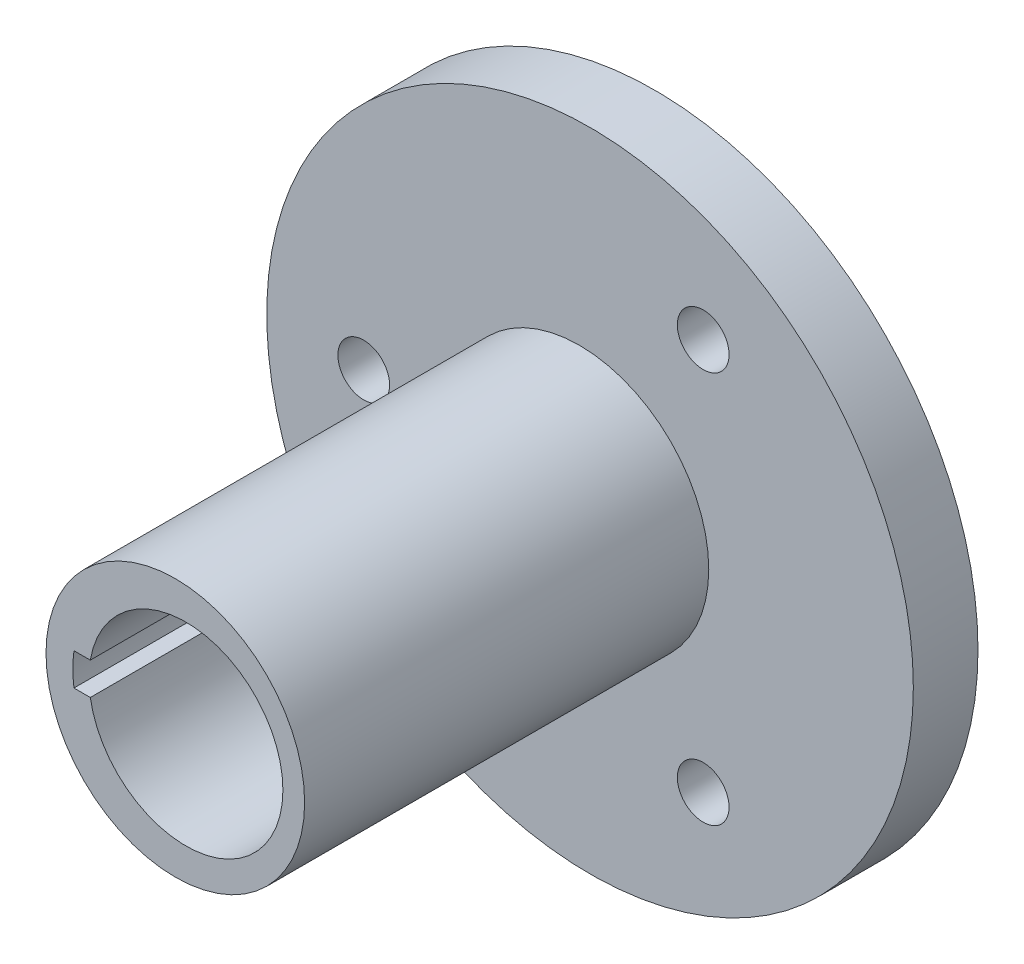
ISO-10303-21;
HEADER;
FILE_DESCRIPTION(('STEP AP214'),'2;1');
FILE_NAME('part.step','',(''),(''),'','','');
FILE_SCHEMA(('AUTOMOTIVE_DESIGN { 1 0 10303 214 1 1 1 1 }'));
ENDSEC;
DATA;
#1=APPLICATION_CONTEXT('core data for automotive mechanical design processes');
#2=APPLICATION_PROTOCOL_DEFINITION('international standard','automotive_design',2000,#1);
#3=PRODUCT_CONTEXT('',#1,'mechanical');
#4=PRODUCT('Part','Part','',(#3));
#5=PRODUCT_RELATED_PRODUCT_CATEGORY('part','',(#4));
#6=PRODUCT_DEFINITION_FORMATION('','',#4);
#7=PRODUCT_DEFINITION_CONTEXT('part definition',#1,'design');
#8=PRODUCT_DEFINITION('design','',#6,#7);
#9=PRODUCT_DEFINITION_SHAPE('','',#8);
#10=(LENGTH_UNIT() NAMED_UNIT(*) SI_UNIT(.MILLI.,.METRE.));
#11=(NAMED_UNIT(*) PLANE_ANGLE_UNIT() SI_UNIT($,.RADIAN.));
#12=(NAMED_UNIT(*) SI_UNIT($,.STERADIAN.) SOLID_ANGLE_UNIT());
#13=UNCERTAINTY_MEASURE_WITH_UNIT(LENGTH_MEASURE(1.E-05),#10,'distance_accuracy_value','');
#14=(GEOMETRIC_REPRESENTATION_CONTEXT(3) GLOBAL_UNCERTAINTY_ASSIGNED_CONTEXT((#13)) GLOBAL_UNIT_ASSIGNED_CONTEXT((#10,
#11,#12)) REPRESENTATION_CONTEXT('',''));
#15=CARTESIAN_POINT('',(0.,0.,0.));
#16=DIRECTION('',(0.,0.,1.));
#17=DIRECTION('',(1.,0.,0.));
#18=AXIS2_PLACEMENT_3D('',#15,#16,#17);
#19=CARTESIAN_POINT('',(0.,0.,0.));
#20=DIRECTION('',(0.,0.,1.));
#21=DIRECTION('',(1.,0.,0.));
#22=AXIS2_PLACEMENT_3D('',#19,#20,#21);
#23=PLANE('',#22);
#24=CARTESIAN_POINT('',(0.,0.,0.));
#25=DIRECTION('',(0.,0.,1.));
#26=DIRECTION('',(1.,0.,0.));
#27=AXIS2_PLACEMENT_3D('',#24,#25,#26);
#28=CIRCLE('',#27,50.);
#29=CARTESIAN_POINT('',(50.,0.,0.));
#30=VERTEX_POINT('',#29);
#31=EDGE_CURVE('E43',#30,#30,#28,.T.);
#32=ORIENTED_EDGE('',*,*,#31,.T.);
#33=EDGE_LOOP('',(#32));
#34=FACE_BOUND('',#33,.T.);
#35=CARTESIAN_POINT('',(-35.,0.,0.));
#36=DIRECTION('',(0.,0.,1.));
#37=DIRECTION('',(1.,0.,0.));
#38=AXIS2_PLACEMENT_3D('',#35,#36,#37);
#39=CIRCLE('',#38,4.);
#40=CARTESIAN_POINT('',(-31.,0.,0.));
#41=VERTEX_POINT('',#40);
#42=EDGE_CURVE('E130',#41,#41,#39,.T.);
#43=ORIENTED_EDGE('',*,*,#42,.F.);
#44=EDGE_LOOP('',(#43));
#45=FACE_BOUND('',#44,.T.);
#46=CARTESIAN_POINT('',(17.5000000000001,30.3108891324553,0.));
#47=DIRECTION('',(0.,0.,1.));
#48=DIRECTION('',(1.,0.,0.));
#49=AXIS2_PLACEMENT_3D('',#46,#47,#48);
#50=CIRCLE('',#49,4.);
#51=CARTESIAN_POINT('',(21.5000000000001,30.3108891324553,0.));
#52=VERTEX_POINT('',#51);
#53=EDGE_CURVE('E127',#52,#52,#50,.T.);
#54=ORIENTED_EDGE('',*,*,#53,.F.);
#55=EDGE_LOOP('',(#54));
#56=FACE_BOUND('',#55,.T.);
#57=CARTESIAN_POINT('',(17.4999999999997,-30.3108891324555,0.));
#58=DIRECTION('',(0.,0.,1.));
#59=DIRECTION('',(1.,0.,0.));
#60=AXIS2_PLACEMENT_3D('',#57,#58,#59);
#61=CIRCLE('',#60,4.);
#62=CARTESIAN_POINT('',(21.4999999999997,-30.3108891324555,0.));
#63=VERTEX_POINT('',#62);
#64=EDGE_CURVE('E121',#63,#63,#61,.T.);
#65=ORIENTED_EDGE('',*,*,#64,.F.);
#66=EDGE_LOOP('',(#65));
#67=FACE_BOUND('',#66,.T.);
#68=CARTESIAN_POINT('',(-1.64092182541253,0.,0.));
#69=DIRECTION('',(0.,0.,1.));
#70=DIRECTION('',(1.,0.,0.));
#71=AXIS2_PLACEMENT_3D('',#68,#69,#70);
#72=CIRCLE('',#71,20.);
#73=CARTESIAN_POINT('',(18.3590781745875,0.,0.));
#74=VERTEX_POINT('',#73);
#75=EDGE_CURVE('E114',#74,#74,#72,.T.);
#76=ORIENTED_EDGE('',*,*,#75,.F.);
#77=EDGE_LOOP('',(#76));
#78=FACE_BOUND('',#77,.T.);
#79=ADVANCED_FACE('F34',(#34,#45,#56,#67,#78),#23,.T.);
#80=CARTESIAN_POINT('',(0.,0.,-10.));
#81=DIRECTION('',(0.,0.,1.));
#82=DIRECTION('',(1.,0.,0.));
#83=AXIS2_PLACEMENT_3D('',#80,#81,#82);
#84=CYLINDRICAL_SURFACE('',#83,50.);
#85=CARTESIAN_POINT('',(0.,0.,-10.));
#86=DIRECTION('',(0.,0.,1.));
#87=DIRECTION('',(1.,0.,0.));
#88=AXIS2_PLACEMENT_3D('',#85,#86,#87);
#89=CIRCLE('',#88,50.);
#90=CARTESIAN_POINT('',(50.,0.,-10.));
#91=VERTEX_POINT('',#90);
#92=EDGE_CURVE('E11',#91,#91,#89,.T.);
#93=ORIENTED_EDGE('',*,*,#92,.T.);
#94=EDGE_LOOP('',(#93));
#95=FACE_BOUND('',#94,.T.);
#96=ORIENTED_EDGE('',*,*,#31,.F.);
#97=EDGE_LOOP('',(#96));
#98=FACE_BOUND('',#97,.T.);
#99=ADVANCED_FACE('F36',(#95,#98),#84,.T.);
#100=CARTESIAN_POINT('',(0.,0.,-10.));
#101=DIRECTION('',(0.,0.,1.));
#102=DIRECTION('',(1.,0.,0.));
#103=AXIS2_PLACEMENT_3D('',#100,#101,#102);
#104=PLANE('',#103);
#105=CARTESIAN_POINT('',(0.,0.,-10.));
#106=DIRECTION('',(0.,0.,1.));
#107=DIRECTION('',(1.,0.,0.));
#108=AXIS2_PLACEMENT_3D('',#105,#106,#107);
#109=CIRCLE('',#108,6.5);
#110=CARTESIAN_POINT('',(6.5,0.,-10.));
#111=VERTEX_POINT('',#110);
#112=EDGE_CURVE('E287',#111,#111,#109,.T.);
#113=ORIENTED_EDGE('',*,*,#112,.T.);
#114=EDGE_LOOP('',(#113));
#115=FACE_BOUND('',#114,.T.);
#116=CARTESIAN_POINT('',(17.4999999999997,-30.3108891324555,-10.));
#117=DIRECTION('',(0.,0.,1.));
#118=DIRECTION('',(1.,0.,0.));
#119=AXIS2_PLACEMENT_3D('',#116,#117,#118);
#120=CIRCLE('',#119,4.);
#121=CARTESIAN_POINT('',(21.4999999999997,-30.3108891324555,-10.));
#122=VERTEX_POINT('',#121);
#123=EDGE_CURVE('E120',#122,#122,#120,.T.);
#124=ORIENTED_EDGE('',*,*,#123,.T.);
#125=EDGE_LOOP('',(#124));
#126=FACE_BOUND('',#125,.T.);
#127=CARTESIAN_POINT('',(17.5000000000001,30.3108891324553,-10.));
#128=DIRECTION('',(0.,0.,1.));
#129=DIRECTION('',(1.,0.,0.));
#130=AXIS2_PLACEMENT_3D('',#127,#128,#129);
#131=CIRCLE('',#130,4.);
#132=CARTESIAN_POINT('',(21.5000000000001,30.3108891324553,-10.));
#133=VERTEX_POINT('',#132);
#134=EDGE_CURVE('E124',#133,#133,#131,.T.);
#135=ORIENTED_EDGE('',*,*,#134,.T.);
#136=EDGE_LOOP('',(#135));
#137=FACE_BOUND('',#136,.T.);
#138=CARTESIAN_POINT('',(-35.,0.,-10.));
#139=DIRECTION('',(0.,0.,1.));
#140=DIRECTION('',(1.,0.,0.));
#141=AXIS2_PLACEMENT_3D('',#138,#139,#140);
#142=CIRCLE('',#141,4.);
#143=CARTESIAN_POINT('',(-31.,0.,-10.));
#144=VERTEX_POINT('',#143);
#145=EDGE_CURVE('E133',#144,#144,#142,.T.);
#146=ORIENTED_EDGE('',*,*,#145,.T.);
#147=EDGE_LOOP('',(#146));
#148=FACE_BOUND('',#147,.T.);
#149=ORIENTED_EDGE('',*,*,#92,.F.);
#150=EDGE_LOOP('',(#149));
#151=FACE_BOUND('',#150,.T.);
#152=ADVANCED_FACE('F143',(#115,#126,#137,#148,#151),#104,.F.);
#153=CARTESIAN_POINT('',(-35.,0.,-10.));
#154=DIRECTION('',(0.,0.,1.));
#155=DIRECTION('',(1.,0.,0.));
#156=AXIS2_PLACEMENT_3D('',#153,#154,#155);
#157=CYLINDRICAL_SURFACE('',#156,4.);
#158=ORIENTED_EDGE('',*,*,#145,.F.);
#159=EDGE_LOOP('',(#158));
#160=FACE_BOUND('',#159,.T.);
#161=ORIENTED_EDGE('',*,*,#42,.T.);
#162=EDGE_LOOP('',(#161));
#163=FACE_BOUND('',#162,.T.);
#164=ADVANCED_FACE('F149',(#160,#163),#157,.F.);
#165=CARTESIAN_POINT('',(17.5000000000001,30.3108891324553,-10.));
#166=DIRECTION('',(0.,0.,1.));
#167=DIRECTION('',(1.,0.,0.));
#168=AXIS2_PLACEMENT_3D('',#165,#166,#167);
#169=CYLINDRICAL_SURFACE('',#168,4.);
#170=ORIENTED_EDGE('',*,*,#134,.F.);
#171=EDGE_LOOP('',(#170));
#172=FACE_BOUND('',#171,.T.);
#173=ORIENTED_EDGE('',*,*,#53,.T.);
#174=EDGE_LOOP('',(#173));
#175=FACE_BOUND('',#174,.T.);
#176=ADVANCED_FACE('F181',(#172,#175),#169,.F.);
#177=CARTESIAN_POINT('',(17.4999999999997,-30.3108891324555,-10.));
#178=DIRECTION('',(0.,0.,1.));
#179=DIRECTION('',(1.,0.,0.));
#180=AXIS2_PLACEMENT_3D('',#177,#178,#179);
#181=CYLINDRICAL_SURFACE('',#180,4.);
#182=ORIENTED_EDGE('',*,*,#123,.F.);
#183=EDGE_LOOP('',(#182));
#184=FACE_BOUND('',#183,.T.);
#185=ORIENTED_EDGE('',*,*,#64,.T.);
#186=EDGE_LOOP('',(#185));
#187=FACE_BOUND('',#186,.T.);
#188=ADVANCED_FACE('F174',(#184,#187),#181,.F.);
#189=CARTESIAN_POINT('',(0.,0.,62.5));
#190=DIRECTION('',(0.,0.,-1.));
#191=DIRECTION('',(-1.,0.,0.));
#192=AXIS2_PLACEMENT_3D('',#189,#190,#191);
#193=CYLINDRICAL_SURFACE('',#192,17.5);
#194=CARTESIAN_POINT('',(0.,0.,0.));
#195=DIRECTION('',(0.,0.,1.));
#196=DIRECTION('',(1.,0.,0.));
#197=AXIS2_PLACEMENT_3D('',#194,#195,#196);
#198=CIRCLE('',#197,17.5);
#199=CARTESIAN_POINT('',(-17.3205080756888,2.5,0.));
#200=VERTEX_POINT('',#199);
#201=CARTESIAN_POINT('',(-17.3205080756888,-2.5,0.));
#202=VERTEX_POINT('',#201);
#203=EDGE_CURVE('E107',#200,#202,#198,.T.);
#204=ORIENTED_EDGE('',*,*,#203,.F.);
#205=DIRECTION('',(0.,0.,-1.));
#206=VECTOR('',#205,1.);
#207=CARTESIAN_POINT('',(-17.3205080756888,2.5,62.5));
#208=LINE('',#207,#206);
#209=CARTESIAN_POINT('',(-17.3205080756888,2.5,62.5));
#210=VERTEX_POINT('',#209);
#211=EDGE_CURVE('E80',#210,#200,#208,.T.);
#212=ORIENTED_EDGE('',*,*,#211,.F.);
#213=CARTESIAN_POINT('',(0.,0.,62.5));
#214=DIRECTION('',(0.,0.,1.));
#215=DIRECTION('',(1.,0.,0.));
#216=AXIS2_PLACEMENT_3D('',#213,#214,#215);
#217=CIRCLE('',#216,17.5);
#218=CARTESIAN_POINT('',(-17.3205080756888,-2.5,62.5));
#219=VERTEX_POINT('',#218);
#220=EDGE_CURVE('E97',#210,#219,#217,.T.);
#221=ORIENTED_EDGE('',*,*,#220,.T.);
#222=DIRECTION('',(0.,0.,-1.));
#223=VECTOR('',#222,1.);
#224=CARTESIAN_POINT('',(-17.3205080756888,-2.5,62.5));
#225=LINE('',#224,#223);
#226=EDGE_CURVE('E76',#219,#202,#225,.T.);
#227=ORIENTED_EDGE('',*,*,#226,.T.);
#228=EDGE_LOOP('',(#204,#212,#221,#227));
#229=FACE_BOUND('',#228,.T.);
#230=ADVANCED_FACE('F172',(#229),#193,.F.);
#231=CARTESIAN_POINT('',(0.,2.5,62.5));
#232=DIRECTION('',(0.,-1.,0.));
#233=DIRECTION('',(0.,0.,-1.));
#234=AXIS2_PLACEMENT_3D('',#231,#232,#233);
#235=PLANE('',#234);
#236=DIRECTION('',(-1.,0.,0.));
#237=VECTOR('',#236,1.);
#238=CARTESIAN_POINT('',(0.,2.5,0.));
#239=LINE('',#238,#237);
#240=CARTESIAN_POINT('',(-14.790199457749,2.5,0.));
#241=VERTEX_POINT('',#240);
#242=EDGE_CURVE('E90',#241,#200,#239,.T.);
#243=ORIENTED_EDGE('',*,*,#242,.F.);
#244=DIRECTION('',(0.,0.,-1.));
#245=VECTOR('',#244,1.);
#246=CARTESIAN_POINT('',(-14.790199457749,2.5,62.5));
#247=LINE('',#246,#245);
#248=CARTESIAN_POINT('',(-14.790199457749,2.5,62.5));
#249=VERTEX_POINT('',#248);
#250=EDGE_CURVE('E85',#249,#241,#247,.T.);
#251=ORIENTED_EDGE('',*,*,#250,.F.);
#252=DIRECTION('',(-1.,0.,0.));
#253=VECTOR('',#252,1.);
#254=CARTESIAN_POINT('',(0.,2.5,62.5));
#255=LINE('',#254,#253);
#256=EDGE_CURVE('E88',#249,#210,#255,.T.);
#257=ORIENTED_EDGE('',*,*,#256,.T.);
#258=ORIENTED_EDGE('',*,*,#211,.T.);
#259=EDGE_LOOP('',(#243,#251,#257,#258));
#260=FACE_BOUND('',#259,.T.);
#261=ADVANCED_FACE('F87',(#260),#235,.T.);
#262=CARTESIAN_POINT('',(0.,0.,62.5));
#263=DIRECTION('',(0.,0.,-1.));
#264=DIRECTION('',(-1.,0.,0.));
#265=AXIS2_PLACEMENT_3D('',#262,#263,#264);
#266=CYLINDRICAL_SURFACE('',#265,15.);
#267=CARTESIAN_POINT('',(0.,0.,0.));
#268=DIRECTION('',(0.,0.,1.));
#269=DIRECTION('',(1.,0.,0.));
#270=AXIS2_PLACEMENT_3D('',#267,#268,#269);
#271=CIRCLE('',#270,15.);
#272=CARTESIAN_POINT('',(-14.790199457749,-2.5,0.));
#273=VERTEX_POINT('',#272);
#274=EDGE_CURVE('E51',#273,#241,#271,.T.);
#275=ORIENTED_EDGE('',*,*,#274,.F.);
#276=DIRECTION('',(0.,0.,-1.));
#277=VECTOR('',#276,1.);
#278=CARTESIAN_POINT('',(-14.790199457749,-2.5,62.5));
#279=LINE('',#278,#277);
#280=CARTESIAN_POINT('',(-14.790199457749,-2.5,62.5));
#281=VERTEX_POINT('',#280);
#282=EDGE_CURVE('E92',#281,#273,#279,.T.);
#283=ORIENTED_EDGE('',*,*,#282,.F.);
#284=CARTESIAN_POINT('',(0.,0.,62.5));
#285=DIRECTION('',(0.,0.,1.));
#286=DIRECTION('',(1.,0.,0.));
#287=AXIS2_PLACEMENT_3D('',#284,#285,#286);
#288=CIRCLE('',#287,15.);
#289=EDGE_CURVE('E96',#281,#249,#288,.T.);
#290=ORIENTED_EDGE('',*,*,#289,.T.);
#291=ORIENTED_EDGE('',*,*,#250,.T.);
#292=EDGE_LOOP('',(#275,#283,#290,#291));
#293=FACE_BOUND('',#292,.T.);
#294=ADVANCED_FACE('F99',(#293),#266,.F.);
#295=CARTESIAN_POINT('',(0.,-2.5,62.5));
#296=DIRECTION('',(0.,-1.,0.));
#297=DIRECTION('',(0.,0.,-1.));
#298=AXIS2_PLACEMENT_3D('',#295,#296,#297);
#299=PLANE('',#298);
#300=DIRECTION('',(-1.,0.,0.));
#301=VECTOR('',#300,1.);
#302=CARTESIAN_POINT('',(0.,-2.5,0.));
#303=LINE('',#302,#301);
#304=EDGE_CURVE('E112',#273,#202,#303,.T.);
#305=ORIENTED_EDGE('',*,*,#304,.T.);
#306=ORIENTED_EDGE('',*,*,#226,.F.);
#307=DIRECTION('',(-1.,0.,0.));
#308=VECTOR('',#307,1.);
#309=CARTESIAN_POINT('',(0.,-2.5,62.5));
#310=LINE('',#309,#308);
#311=EDGE_CURVE('E60',#281,#219,#310,.T.);
#312=ORIENTED_EDGE('',*,*,#311,.F.);
#313=ORIENTED_EDGE('',*,*,#282,.T.);
#314=EDGE_LOOP('',(#305,#306,#312,#313));
#315=FACE_BOUND('',#314,.T.);
#316=ADVANCED_FACE('F204',(#315),#299,.F.);
#317=CARTESIAN_POINT('',(-1.64092182541253,0.,62.5));
#318=DIRECTION('',(0.,0.,-1.));
#319=DIRECTION('',(-1.,0.,0.));
#320=AXIS2_PLACEMENT_3D('',#317,#318,#319);
#321=CYLINDRICAL_SURFACE('',#320,20.);
#322=CARTESIAN_POINT('',(-1.64092182541253,0.,62.5));
#323=DIRECTION('',(0.,0.,1.));
#324=DIRECTION('',(1.,0.,0.));
#325=AXIS2_PLACEMENT_3D('',#322,#323,#324);
#326=CIRCLE('',#325,20.);
#327=CARTESIAN_POINT('',(18.3590781745875,0.,62.5));
#328=VERTEX_POINT('',#327);
#329=EDGE_CURVE('E101',#328,#328,#326,.T.);
#330=ORIENTED_EDGE('',*,*,#329,.F.);
#331=EDGE_LOOP('',(#330));
#332=FACE_BOUND('',#331,.T.);
#333=ORIENTED_EDGE('',*,*,#75,.T.);
#334=EDGE_LOOP('',(#333));
#335=FACE_BOUND('',#334,.T.);
#336=ADVANCED_FACE('F166',(#332,#335),#321,.T.);
#337=CARTESIAN_POINT('',(0.,0.,62.5));
#338=DIRECTION('',(0.,0.,1.));
#339=DIRECTION('',(1.,0.,0.));
#340=AXIS2_PLACEMENT_3D('',#337,#338,#339);
#341=PLANE('',#340);
#342=ORIENTED_EDGE('',*,*,#220,.F.);
#343=ORIENTED_EDGE('',*,*,#256,.F.);
#344=ORIENTED_EDGE('',*,*,#289,.F.);
#345=ORIENTED_EDGE('',*,*,#311,.T.);
#346=EDGE_LOOP('',(#342,#343,#344,#345));
#347=FACE_BOUND('',#346,.T.);
#348=ORIENTED_EDGE('',*,*,#329,.T.);
#349=EDGE_LOOP('',(#348));
#350=FACE_BOUND('',#349,.T.);
#351=ADVANCED_FACE('F94',(#347,#350),#341,.T.);
#352=CARTESIAN_POINT('',(0.,0.,0.));
#353=DIRECTION('',(0.,0.,1.));
#354=DIRECTION('',(1.,0.,0.));
#355=AXIS2_PLACEMENT_3D('',#352,#353,#354);
#356=CIRCLE('',#355,6.5);
#357=CARTESIAN_POINT('',(6.5,0.,0.));
#358=VERTEX_POINT('',#357);
#359=EDGE_CURVE('E38',#358,#358,#356,.T.);
#360=ORIENTED_EDGE('',*,*,#359,.F.);
#361=EDGE_LOOP('',(#360));
#362=FACE_BOUND('',#361,.T.);
#363=ORIENTED_EDGE('',*,*,#203,.T.);
#364=ORIENTED_EDGE('',*,*,#304,.F.);
#365=ORIENTED_EDGE('',*,*,#274,.T.);
#366=ORIENTED_EDGE('',*,*,#242,.T.);
#367=EDGE_LOOP('',(#363,#364,#365,#366));
#368=FACE_BOUND('',#367,.T.);
#369=ADVANCED_FACE('F152',(#362,#368),#23,.T.);
#370=CARTESIAN_POINT('',(0.,0.,-10.));
#371=DIRECTION('',(0.,0.,1.));
#372=DIRECTION('',(1.,0.,0.));
#373=AXIS2_PLACEMENT_3D('',#370,#371,#372);
#374=CYLINDRICAL_SURFACE('',#373,6.5);
#375=ORIENTED_EDGE('',*,*,#359,.T.);
#376=EDGE_LOOP('',(#375));
#377=FACE_BOUND('',#376,.T.);
#378=ORIENTED_EDGE('',*,*,#112,.F.);
#379=EDGE_LOOP('',(#378));
#380=FACE_BOUND('',#379,.T.);
#381=ADVANCED_FACE('F158',(#377,#380),#374,.F.);
#382=CLOSED_SHELL('',(#79,#99,#152,#164,#176,#188,#230,#261,#294,#316,#336,#351,#369,#381));
#383=MANIFOLD_SOLID_BREP('B2',#382);
#384=ADVANCED_BREP_SHAPE_REPRESENTATION('',(#18,#383),#14);
#385=SHAPE_DEFINITION_REPRESENTATION(#9,#384);
ENDSEC;
END-ISO-10303-21;
